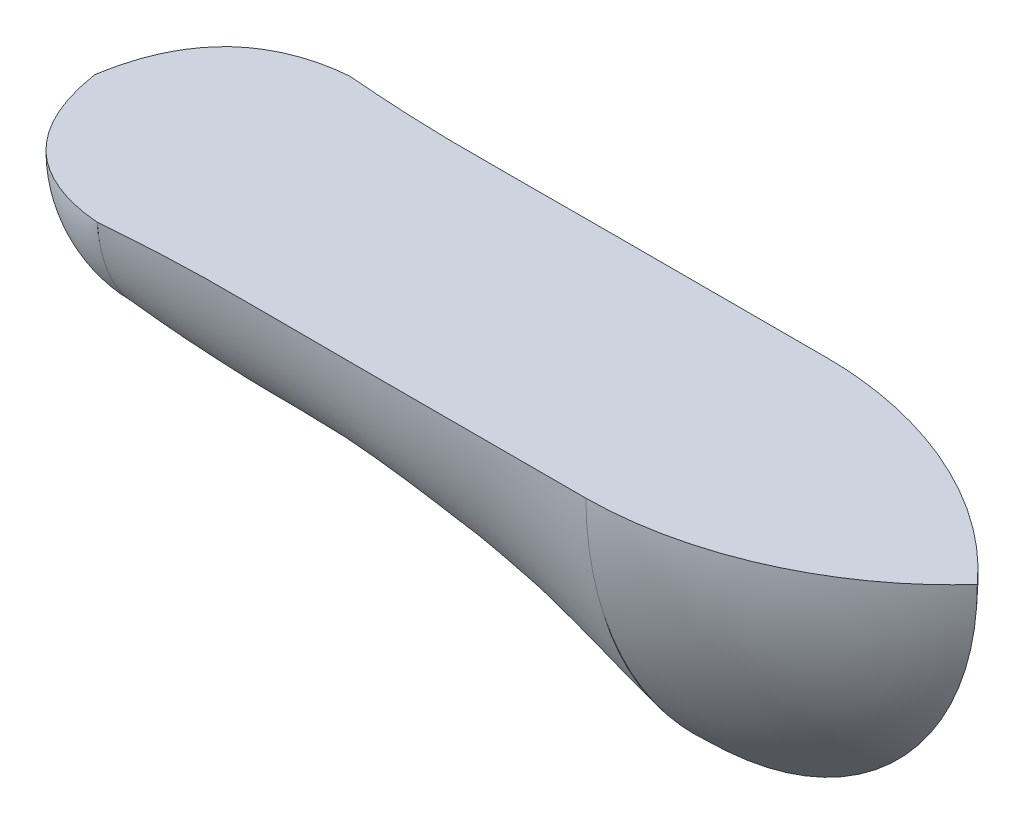
ISO-10303-21;
HEADER;
FILE_DESCRIPTION(('STEP AP214'),'2;1');
FILE_NAME('part.step','',(''),(''),'','','');
FILE_SCHEMA(('AUTOMOTIVE_DESIGN { 1 0 10303 214 1 1 1 1 }'));
ENDSEC;
DATA;
#1=APPLICATION_CONTEXT('core data for automotive mechanical design processes');
#2=APPLICATION_PROTOCOL_DEFINITION('international standard','automotive_design',2000,#1);
#3=PRODUCT_CONTEXT('',#1,'mechanical');
#4=PRODUCT('Part','Part','',(#3));
#5=PRODUCT_RELATED_PRODUCT_CATEGORY('part','',(#4));
#6=PRODUCT_DEFINITION_FORMATION('','',#4);
#7=PRODUCT_DEFINITION_CONTEXT('part definition',#1,'design');
#8=PRODUCT_DEFINITION('design','',#6,#7);
#9=PRODUCT_DEFINITION_SHAPE('','',#8);
#10=(LENGTH_UNIT() NAMED_UNIT(*) SI_UNIT(.MILLI.,.METRE.));
#11=(NAMED_UNIT(*) PLANE_ANGLE_UNIT() SI_UNIT($,.RADIAN.));
#12=(NAMED_UNIT(*) SI_UNIT($,.STERADIAN.) SOLID_ANGLE_UNIT());
#13=UNCERTAINTY_MEASURE_WITH_UNIT(LENGTH_MEASURE(1.E-05),#10,'distance_accuracy_value','');
#14=(GEOMETRIC_REPRESENTATION_CONTEXT(3) GLOBAL_UNCERTAINTY_ASSIGNED_CONTEXT((#13)) GLOBAL_UNIT_ASSIGNED_CONTEXT((#10,
#11,#12)) REPRESENTATION_CONTEXT('',''));
#15=CARTESIAN_POINT('',(0.,0.,0.));
#16=DIRECTION('',(0.,0.,1.));
#17=DIRECTION('',(1.,0.,0.));
#18=AXIS2_PLACEMENT_3D('',#15,#16,#17);
#19=CARTESIAN_POINT('',(131.816422352848,-59.0122671081871,34.7224523052919));
#20=DIRECTION('',(-1.,0.,0.));
#21=DIRECTION('',(0.,0.,1.));
#22=AXIS2_PLACEMENT_3D('',#19,#20,#21);
#23=PLANE('',#22);
#24=CARTESIAN_POINT('',(131.816422352848,0.,47.6997916780497));
#25=CARTESIAN_POINT('',(131.816422352848,-39.9283330976788,47.4989625477255));
#26=CARTESIAN_POINT('',(131.816422352848,-79.9498809986171,29.6913803366463));
#27=CARTESIAN_POINT('',(131.816422352848,-106.566200226632,0.));
#28=B_SPLINE_CURVE_WITH_KNOTS('',3,(#24,#25,#26,#27),.UNSPECIFIED.,.F.,.F.,(4,4),(0.,1.),.UNSPECIFIED.);
#29=CARTESIAN_POINT('',(131.816422352848,-43.4553935713046,40.6071201429122));
#30=VERTEX_POINT('',#29);
#31=CARTESIAN_POINT('',(131.816422352848,-90.4081398241308,15.2989475359607));
#32=VERTEX_POINT('',#31);
#33=EDGE_CURVE('E185',#30,#32,#28,.T.);
#34=ORIENTED_EDGE('',*,*,#33,.F.);
#35=CARTESIAN_POINT('',(131.816422352848,0.,47.6997916780497));
#36=CARTESIAN_POINT('',(131.816422352848,-64.7414341030582,45.5950087715589));
#37=CARTESIAN_POINT('',(131.816422352848,-106.566200226632,0.));
#38=B_SPLINE_CURVE_WITH_KNOTS('',2,(#35,#36,#37),.UNSPECIFIED.,.F.,.F.,(3,3),(0.,1.),.UNSPECIFIED.);
#39=EDGE_CURVE('E70',#30,#32,#38,.T.);
#40=ORIENTED_EDGE('',*,*,#39,.T.);
#41=EDGE_LOOP('',(#34,#40));
#42=FACE_BOUND('',#41,.T.);
#43=ADVANCED_FACE('F65',(#42),#23,.F.);
#44=CARTESIAN_POINT('',(131.816422352848,-106.566200226632,0.));
#45=CARTESIAN_POINT('',(131.816422352848,-79.9498809986171,-29.6913803366464));
#46=CARTESIAN_POINT('',(131.816422352848,-39.9283330976788,-47.4989625477255));
#47=CARTESIAN_POINT('',(131.816422352848,0.,-47.6997916780497));
#48=B_SPLINE_CURVE_WITH_KNOTS('',3,(#44,#45,#46,#47),.UNSPECIFIED.,.F.,.F.,(4,4),(0.,1.),.UNSPECIFIED.);
#49=CARTESIAN_POINT('',(131.816422352848,-90.4081398241278,-15.2989475359631));
#50=VERTEX_POINT('',#49);
#51=CARTESIAN_POINT('',(131.816422352848,-43.4553931780699,-40.6071202658206));
#52=VERTEX_POINT('',#51);
#53=EDGE_CURVE('E84',#50,#52,#48,.T.);
#54=ORIENTED_EDGE('',*,*,#53,.F.);
#55=CARTESIAN_POINT('',(131.816422352848,0.,-47.6997916780497));
#56=CARTESIAN_POINT('',(131.816422352848,-64.7414341030582,-45.5950087715589));
#57=CARTESIAN_POINT('',(131.816422352848,-106.566200226632,0.));
#58=B_SPLINE_CURVE_WITH_KNOTS('',2,(#55,#56,#57),.UNSPECIFIED.,.F.,.F.,(3,3),(0.,1.),.UNSPECIFIED.);
#59=EDGE_CURVE('E209',#52,#50,#58,.T.);
#60=ORIENTED_EDGE('',*,*,#59,.F.);
#61=EDGE_LOOP('',(#54,#60));
#62=FACE_BOUND('',#61,.T.);
#63=ADVANCED_FACE('F613',(#62),#23,.F.);
#64=CARTESIAN_POINT('',(-58.6835776471518,-34.4172644207204,35.5589947041966));
#65=DIRECTION('',(-1.,0.,0.));
#66=DIRECTION('',(0.,0.,1.));
#67=AXIS2_PLACEMENT_3D('',#64,#65,#66);
#68=PLANE('',#67);
#69=CARTESIAN_POINT('',(-58.6835776471518,0.,-49.7894442540128));
#70=CARTESIAN_POINT('',(-58.6835776471518,-43.4345288414408,-46.2232672813869));
#71=CARTESIAN_POINT('',(-58.6835776471518,-50.8,0.));
#72=B_SPLINE_CURVE_WITH_KNOTS('',2,(#69,#70,#71),.UNSPECIFIED.,.F.,.F.,(3,3),(0.,1.),.UNSPECIFIED.);
#73=CARTESIAN_POINT('',(-58.6835776471519,-44.1716494014847,-21.8945675320616));
#74=VERTEX_POINT('',#73);
#75=CARTESIAN_POINT('',(-58.6835776471518,-32.6460209973409,-37.2045900628193));
#76=VERTEX_POINT('',#75);
#77=EDGE_CURVE('E341',#74,#76,#72,.F.);
#78=ORIENTED_EDGE('',*,*,#77,.F.);
#79=CARTESIAN_POINT('',(-58.6835776471518,0.,-49.7894442540128));
#80=CARTESIAN_POINT('',(-58.6835776471518,-11.3053774098099,-49.0060485353922));
#81=CARTESIAN_POINT('',(-58.6835776471518,-30.0354301971617,-43.0409059333521));
#82=CARTESIAN_POINT('',(-58.6835776471518,-45.8648995414801,-21.5469878436581));
#83=CARTESIAN_POINT('',(-58.6835776471518,-49.5760104239876,-7.53480010945913));
#84=CARTESIAN_POINT('',(-58.6835776471518,-50.8,0.));
#85=B_SPLINE_CURVE_WITH_KNOTS('',3,(#79,#80,#81,#82,#83,#84),.UNSPECIFIED.,.F.,.F.,(4,1,1,4),
(0.,0.445313014205887,0.703997856148716,1.),.UNSPECIFIED.);
#86=EDGE_CURVE('E92',#76,#74,#85,.T.);
#87=ORIENTED_EDGE('',*,*,#86,.F.);
#88=EDGE_LOOP('',(#78,#87));
#89=FACE_BOUND('',#88,.T.);
#90=ADVANCED_FACE('F67',(#89),#68,.T.);
#91=CARTESIAN_POINT('',(-58.6835776471518,-31.9653716330667,-37.7918671025434));
#92=VERTEX_POINT('',#91);
#93=CARTESIAN_POINT('',(-58.6835776471518,-12.0474860174323,-47.8044391261713));
#94=VERTEX_POINT('',#93);
#95=EDGE_CURVE('E322',#92,#94,#72,.F.);
#96=ORIENTED_EDGE('',*,*,#95,.F.);
#97=EDGE_CURVE('E494',#94,#92,#85,.T.);
#98=ORIENTED_EDGE('',*,*,#97,.F.);
#99=EDGE_LOOP('',(#96,#98));
#100=FACE_BOUND('',#99,.T.);
#101=ADVANCED_FACE('F605',(#100),#68,.T.);
#102=CARTESIAN_POINT('',(-58.6835776471518,0.,49.7894442540128));
#103=CARTESIAN_POINT('',(-58.6835776471518,-43.4345288414408,46.2232672813869));
#104=CARTESIAN_POINT('',(-58.6835776471518,-50.8,0.));
#105=B_SPLINE_CURVE_WITH_KNOTS('',2,(#102,#103,#104),.UNSPECIFIED.,.F.,.F.,(3,3),(0.,1.),.UNSPECIFIED.);
#106=CARTESIAN_POINT('',(-58.6835776471519,-31.9653716330448,37.7918671025619));
#107=VERTEX_POINT('',#106);
#108=CARTESIAN_POINT('',(-58.6835776471518,-12.0474860174339,47.8044391261709));
#109=VERTEX_POINT('',#108);
#110=EDGE_CURVE('E222',#107,#109,#105,.F.);
#111=ORIENTED_EDGE('',*,*,#110,.T.);
#112=CARTESIAN_POINT('',(-58.6835776471518,-50.8,0.));
#113=CARTESIAN_POINT('',(-58.6835776471518,-49.5760104239876,7.53480010945916));
#114=CARTESIAN_POINT('',(-58.6835776471518,-45.8648995414801,21.5469878436581));
#115=CARTESIAN_POINT('',(-58.6835776471518,-30.0354301971617,43.0409059333522));
#116=CARTESIAN_POINT('',(-58.6835776471518,-11.3053774098098,49.0060485353922));
#117=CARTESIAN_POINT('',(-58.6835776471518,0.,49.7894442540128));
#118=B_SPLINE_CURVE_WITH_KNOTS('',3,(#112,#113,#114,#115,#116,#117),.UNSPECIFIED.,.F.,.F.,(4,1,
1,4),(0.,0.296002143851284,0.554686985794113,1.),.UNSPECIFIED.);
#119=EDGE_CURVE('E482',#107,#109,#118,.T.);
#120=ORIENTED_EDGE('',*,*,#119,.F.);
#121=EDGE_LOOP('',(#111,#120));
#122=FACE_BOUND('',#121,.T.);
#123=ADVANCED_FACE('F607',(#122),#68,.T.);
#124=CARTESIAN_POINT('',(-58.6835776471518,-44.1716503534535,21.8945656162064));
#125=VERTEX_POINT('',#124);
#126=CARTESIAN_POINT('',(-58.6835776471518,-32.6460209973468,37.2045900628142));
#127=VERTEX_POINT('',#126);
#128=EDGE_CURVE('E76',#125,#127,#105,.F.);
#129=ORIENTED_EDGE('',*,*,#128,.T.);
#130=EDGE_CURVE('E452',#125,#127,#118,.T.);
#131=ORIENTED_EDGE('',*,*,#130,.F.);
#132=EDGE_LOOP('',(#129,#131));
#133=FACE_BOUND('',#132,.T.);
#134=ADVANCED_FACE('F612',(#133),#68,.T.);
#135=CARTESIAN_POINT('',(-58.6835776471518,-50.8,0.));
#136=VERTEX_POINT('',#135);
#137=CARTESIAN_POINT('',(-58.6835776471518,-48.9861214219064,-8.74181358001302));
#138=VERTEX_POINT('',#137);
#139=EDGE_CURVE('E509',#136,#138,#72,.F.);
#140=ORIENTED_EDGE('',*,*,#139,.F.);
#141=EDGE_CURVE('E175',#138,#136,#85,.T.);
#142=ORIENTED_EDGE('',*,*,#141,.F.);
#143=EDGE_LOOP('',(#140,#142));
#144=FACE_BOUND('',#143,.T.);
#145=ADVANCED_FACE('F508',(#144),#68,.T.);
#146=CARTESIAN_POINT('',(-58.6835776471518,-48.9861214219057,8.74181358001579));
#147=VERTEX_POINT('',#146);
#148=EDGE_CURVE('E12',#136,#147,#105,.F.);
#149=ORIENTED_EDGE('',*,*,#148,.T.);
#150=EDGE_CURVE('E477',#136,#147,#118,.T.);
#151=ORIENTED_EDGE('',*,*,#150,.F.);
#152=EDGE_LOOP('',(#149,#151));
#153=FACE_BOUND('',#152,.T.);
#154=ADVANCED_FACE('F253',(#153),#68,.T.);
#155=CARTESIAN_POINT('',(131.816422352848,-106.566200226632,0.));
#156=CARTESIAN_POINT('',(119.109169090257,-100.693059423052,0.));
#157=CARTESIAN_POINT('',(93.7178635933245,-89.6393239271695,0.));
#158=CARTESIAN_POINT('',(56.0367616243776,-68.8417754410907,0.));
#159=CARTESIAN_POINT('',(17.5720054016219,-62.3294225142498,0.));
#160=CARTESIAN_POINT('',(-20.7245857030779,-62.9126811219029,0.));
#161=CARTESIAN_POINT('',(-46.1895235930978,-55.4223423423423,0.));
#162=CARTESIAN_POINT('',(-58.6835776471519,-50.8,0.));
#163=CARTESIAN_POINT('',(131.816422352848,-78.6830228109162,30.3966725143726));
#164=CARTESIAN_POINT('',(119.111586844454,-74.7675956085296,30.3966725143726));
#165=CARTESIAN_POINT('',(93.7173839848812,-66.0066192149846,26.8829339201581));
#166=CARTESIAN_POINT('',(56.0348358832331,-59.027241803324,28.9816107978587));
#167=CARTESIAN_POINT('',(17.5799888660408,-53.2268620729555,27.2340470665521));
#168=CARTESIAN_POINT('',(-20.7546363783925,-56.1855331654728,26.1608503031107));
#169=CARTESIAN_POINT('',(-46.1240561681897,-48.9712474558555,30.46732333113));
#170=CARTESIAN_POINT('',(-58.6835776471519,-45.8896858942939,30.8155115209246));
#171=CARTESIAN_POINT('',(131.816422352848,-43.1609560687055,46.2966030737225));
#172=CARTESIAN_POINT('',(119.114004598651,-41.2032424675122,46.2966030737225));
#173=CARTESIAN_POINT('',(93.7169043764379,-36.1268445725948,42.7862740104161));
#174=CARTESIAN_POINT('',(56.0329101420887,-36.0799833229604,44.8697302820663));
#175=CARTESIAN_POINT('',(17.5879723304597,-32.450387901539,43.1768745136056));
#176=CARTESIAN_POINT('',(-20.7846870537071,-35.2146394581718,41.9007566429753));
#177=CARTESIAN_POINT('',(-46.0585887432817,-30.4971333417413,46.7156165593397));
#178=CARTESIAN_POINT('',(-58.6835776471519,-28.9563525609606,47.4119929389289));
#179=CARTESIAN_POINT('',(131.816422352848,0.,47.6997916780497));
#180=CARTESIAN_POINT('',(119.116422352848,0.,47.6997916780497));
#181=CARTESIAN_POINT('',(93.7164247679946,0.,47.710020270774));
#182=CARTESIAN_POINT('',(56.0309844009442,0.,47.6643584526229));
#183=CARTESIAN_POINT('',(17.5959557948787,0.,47.8284823411605));
#184=CARTESIAN_POINT('',(-20.8147377290218,0.,47.2197190195939));
#185=CARTESIAN_POINT('',(-45.9931213183736,0.,48.7448796846291));
#186=CARTESIAN_POINT('',(-58.6835776471519,0.,49.7894442540128));
#187=B_SPLINE_SURFACE_WITH_KNOTS('',3,3,((#155,#156,#157,#158,#159,#160,#161,#162),(#163,#164,
#165,#166,#167,#168,#169,#170),(#171,#172,#173,#174,#175,#176,#177,#178),(#179,#180,#181,#182,
#183,#184,#185,#186)),.UNSPECIFIED.,.F.,.F.,.F.,(4,4),(4,1,1,1,1,4),(0.,1.),(0.,
0.20255279436426,0.404659715342169,0.603036822376503,0.800558261550841,1.),.UNSPECIFIED.);
#188=CARTESIAN_POINT('',(131.816422352848,0.,47.6997916780497));
#189=VERTEX_POINT('',#188);
#190=EDGE_CURVE('E219',#189,#30,#38,.T.);
#191=CARTESIAN_POINT('',(131.816422352848,0.,47.6997916780497));
#192=CARTESIAN_POINT('',(119.116422352848,0.,47.6997916780497));
#193=CARTESIAN_POINT('',(93.7164247679946,0.,47.710020270774));
#194=CARTESIAN_POINT('',(56.0309844009442,0.,47.6643584526229));
#195=CARTESIAN_POINT('',(17.5959557948787,0.,47.8284823411605));
#196=CARTESIAN_POINT('',(-20.8147377290218,0.,47.2197190195939));
#197=CARTESIAN_POINT('',(-45.9931213183736,0.,48.7448796846291));
#198=CARTESIAN_POINT('',(-58.6835776471519,0.,49.7894442540128));
#199=B_SPLINE_CURVE_WITH_KNOTS('',3,(#191,#192,#193,#194,#195,#196,#197,#198),.UNSPECIFIED.,.F.,
.F.,(4,1,1,1,1,4),(0.,0.20255279436426,0.404659715342169,0.603036822376503,0.800558261550841,
1.),.UNSPECIFIED.);
#200=CARTESIAN_POINT('',(-58.6835776471518,0.,49.7894442540128));
#201=VERTEX_POINT('',#200);
#202=EDGE_CURVE('E218',#189,#201,#199,.T.);
#203=EDGE_CURVE('E413',#109,#201,#105,.F.);
#204=CARTESIAN_POINT('',(-58.6835776471518,-31.9745251926052,37.7841357895646));
#205=VERTEX_POINT('',#204);
#206=EDGE_CURVE('E291',#205,#107,#118,.T.);
#207=CARTESIAN_POINT('',(-58.6835776471519,-32.645089029017,37.2054115691293));
#208=VERTEX_POINT('',#207);
#209=EDGE_CURVE('E419',#208,#205,#105,.F.);
#210=EDGE_CURVE('E443',#127,#208,#118,.T.);
#211=EDGE_CURVE('E211',#147,#125,#105,.F.);
#212=CARTESIAN_POINT('',(131.816422352848,-106.566200226632,0.));
#213=CARTESIAN_POINT('',(119.109169090257,-100.693059423052,0.));
#214=CARTESIAN_POINT('',(93.7178635933245,-89.6393239271695,0.));
#215=CARTESIAN_POINT('',(56.0367616243776,-68.8417754410907,0.));
#216=CARTESIAN_POINT('',(17.5720054016219,-62.3294225142498,0.));
#217=CARTESIAN_POINT('',(-20.7245857030779,-62.9126811219029,0.));
#218=CARTESIAN_POINT('',(-46.1895235930978,-55.4223423423423,0.));
#219=CARTESIAN_POINT('',(-58.6835776471519,-50.8,0.));
#220=B_SPLINE_CURVE_WITH_KNOTS('',3,(#212,#213,#214,#215,#216,#217,#218,#219),.UNSPECIFIED.,.F.,
.F.,(4,1,1,1,1,4),(0.,0.20255279436426,0.404659715342169,0.603036822376503,0.800558261550841,
1.),.UNSPECIFIED.);
#221=CARTESIAN_POINT('',(131.816422352848,-106.566200226632,0.));
#222=VERTEX_POINT('',#221);
#223=EDGE_CURVE('E206',#222,#136,#220,.T.);
#224=EDGE_CURVE('E166',#32,#222,#38,.T.);
#225=ORIENTED_EDGE('',*,*,#190,.F.);
#226=ORIENTED_EDGE('',*,*,#202,.T.);
#227=ORIENTED_EDGE('',*,*,#203,.F.);
#228=ORIENTED_EDGE('',*,*,#110,.F.);
#229=ORIENTED_EDGE('',*,*,#206,.F.);
#230=ORIENTED_EDGE('',*,*,#209,.F.);
#231=ORIENTED_EDGE('',*,*,#210,.F.);
#232=ORIENTED_EDGE('',*,*,#128,.F.);
#233=ORIENTED_EDGE('',*,*,#211,.F.);
#234=ORIENTED_EDGE('',*,*,#148,.F.);
#235=ORIENTED_EDGE('',*,*,#223,.F.);
#236=ORIENTED_EDGE('',*,*,#224,.F.);
#237=ORIENTED_EDGE('',*,*,#39,.F.);
#238=EDGE_LOOP('',(#225,#226,#227,#228,#229,#230,#231,#232,#233,#234,#235,#236,#237));
#239=FACE_BOUND('',#238,.T.);
#240=ADVANCED_FACE('F215',(#239),#187,.T.);
#241=CARTESIAN_POINT('',(131.816422352848,0.,47.6997916780497));
#242=DIRECTION('',(0.,1.,0.));
#243=DIRECTION('',(0.,0.,-1.));
#244=AXIS2_PLACEMENT_3D('',#241,#242,#243);
#245=PLANE('',#244);
#246=CARTESIAN_POINT('',(238.38262257948,3.60822483003176E-13,0.));
#247=CARTESIAN_POINT('',(211.766303351465,2.77555756156289E-13,-29.6913803366464));
#248=CARTESIAN_POINT('',(171.744755450527,1.38777878078145E-13,-47.4989625477255));
#249=CARTESIAN_POINT('',(131.816422352848,0.,-47.6997916780497));
#250=B_SPLINE_CURVE_WITH_KNOTS('',3,(#246,#247,#248,#249),.UNSPECIFIED.,.F.,.F.,(4,4),(0.,1.),.UNSPECIFIED.);
#251=CARTESIAN_POINT('',(238.38262257948,3.60822483003176E-13,0.));
#252=VERTEX_POINT('',#251);
#253=CARTESIAN_POINT('',(131.816422352848,-9.0974127804038E-06,-47.6997913822869));
#254=VERTEX_POINT('',#253);
#255=EDGE_CURVE('E191',#252,#254,#250,.T.);
#256=ORIENTED_EDGE('',*,*,#255,.T.);
#257=CARTESIAN_POINT('',(131.816422352848,0.,-47.6997916780497));
#258=CARTESIAN_POINT('',(119.116422352848,0.,-47.6997916780497));
#259=CARTESIAN_POINT('',(93.7164247679946,0.,-47.710020270774));
#260=CARTESIAN_POINT('',(56.0309844009442,0.,-47.6643584526229));
#261=CARTESIAN_POINT('',(17.5959557948787,0.,-47.8284823411605));
#262=CARTESIAN_POINT('',(-20.8147377290218,0.,-47.2197190195939));
#263=CARTESIAN_POINT('',(-45.9931213183736,0.,-48.7448796846291));
#264=CARTESIAN_POINT('',(-58.6835776471519,0.,-49.7894442540128));
#265=B_SPLINE_CURVE_WITH_KNOTS('',3,(#257,#258,#259,#260,#261,#262,#263,#264),.UNSPECIFIED.,.F.,
.F.,(4,1,1,1,1,4),(0.,0.20255279436426,0.404659715342169,0.603036822376503,0.800558261550841,
1.),.UNSPECIFIED.);
#266=CARTESIAN_POINT('',(-58.6835776471518,0.,-49.7894442540128));
#267=VERTEX_POINT('',#266);
#268=EDGE_CURVE('E385',#254,#267,#265,.T.);
#269=ORIENTED_EDGE('',*,*,#268,.T.);
#270=CARTESIAN_POINT('',(-58.6835776471518,0.,-49.7894442540128));
#271=CARTESIAN_POINT('',(-69.9889550569617,0.,-49.0060485353922));
#272=CARTESIAN_POINT('',(-88.7190078443135,1.04083408558608E-13,-43.0409059333521));
#273=CARTESIAN_POINT('',(-104.548477188632,1.59594559789866E-13,-21.5469878436581));
#274=CARTESIAN_POINT('',(-108.259588071139,1.73472347597681E-13,-7.53480010945913));
#275=CARTESIAN_POINT('',(-109.483577647152,1.80411241501588E-13,0.));
#276=B_SPLINE_CURVE_WITH_KNOTS('',3,(#270,#271,#272,#273,#274,#275),.UNSPECIFIED.,.F.,.F.,(4,1,
1,4),(0.,0.445313014205887,0.703997856148716,1.),.UNSPECIFIED.);
#277=CARTESIAN_POINT('',(-109.483577647152,1.80411241501588E-13,0.));
#278=VERTEX_POINT('',#277);
#279=EDGE_CURVE('E437',#267,#278,#276,.T.);
#280=ORIENTED_EDGE('',*,*,#279,.T.);
#281=CARTESIAN_POINT('',(-109.483577647152,1.80411241501588E-13,0.));
#282=CARTESIAN_POINT('',(-108.25958807114,1.73472347597681E-13,7.53480010945916));
#283=CARTESIAN_POINT('',(-104.548477188632,1.59594559789866E-13,21.5469878436581));
#284=CARTESIAN_POINT('',(-88.7190078443135,1.04083408558608E-13,43.0409059333522));
#285=CARTESIAN_POINT('',(-69.9889550569617,0.,49.0060485353922));
#286=CARTESIAN_POINT('',(-58.6835776471518,0.,49.7894442540128));
#287=B_SPLINE_CURVE_WITH_KNOTS('',3,(#281,#282,#283,#284,#285,#286),.UNSPECIFIED.,.F.,.F.,(4,1,
1,4),(0.,0.296002143851284,0.554686985794113,1.),.UNSPECIFIED.);
#288=EDGE_CURVE('E432',#278,#201,#287,.T.);
#289=ORIENTED_EDGE('',*,*,#288,.T.);
#290=ORIENTED_EDGE('',*,*,#202,.F.);
#291=CARTESIAN_POINT('',(131.816422352848,0.,47.6997916780497));
#292=CARTESIAN_POINT('',(171.744755450527,1.38777878078145E-13,47.4989625477255));
#293=CARTESIAN_POINT('',(211.766303351465,2.77555756156289E-13,29.6913803366463));
#294=CARTESIAN_POINT('',(238.38262257948,3.60822483003176E-13,0.));
#295=B_SPLINE_CURVE_WITH_KNOTS('',3,(#291,#292,#293,#294),.UNSPECIFIED.,.F.,.F.,(4,4),(0.,1.),.UNSPECIFIED.);
#296=EDGE_CURVE('E198',#189,#252,#295,.T.);
#297=ORIENTED_EDGE('',*,*,#296,.T.);
#298=EDGE_LOOP('',(#256,#269,#280,#289,#290,#297));
#299=FACE_BOUND('',#298,.T.);
#300=ADVANCED_FACE('F252',(#299),#245,.T.);
#301=CARTESIAN_POINT('',(131.816422352848,-106.566200226632,0.));
#302=CARTESIAN_POINT('',(119.109169090257,-100.693059423052,0.));
#303=CARTESIAN_POINT('',(93.7178635933245,-89.6393239271695,0.));
#304=CARTESIAN_POINT('',(56.0367616243776,-68.8417754410907,0.));
#305=CARTESIAN_POINT('',(17.5720054016219,-62.3294225142498,0.));
#306=CARTESIAN_POINT('',(-20.7245857030779,-62.9126811219029,0.));
#307=CARTESIAN_POINT('',(-46.1895235930978,-55.4223423423423,0.));
#308=CARTESIAN_POINT('',(-58.6835776471519,-50.8,0.));
#309=CARTESIAN_POINT('',(131.816422352848,-78.6830228109162,-30.3966725143726));
#310=CARTESIAN_POINT('',(119.111586844454,-74.7675956085296,-30.3966725143726));
#311=CARTESIAN_POINT('',(93.7173839848812,-66.0066192149846,-26.8829339201581));
#312=CARTESIAN_POINT('',(56.0348358832331,-59.027241803324,-28.9816107978587));
#313=CARTESIAN_POINT('',(17.5799888660408,-53.2268620729555,-27.2340470665521));
#314=CARTESIAN_POINT('',(-20.7546363783925,-56.1855331654728,-26.1608503031107));
#315=CARTESIAN_POINT('',(-46.1240561681897,-48.9712474558555,-30.46732333113));
#316=CARTESIAN_POINT('',(-58.6835776471519,-45.8896858942939,-30.8155115209246));
#317=CARTESIAN_POINT('',(131.816422352848,-43.1609560687055,-46.2966030737225));
#318=CARTESIAN_POINT('',(119.114004598651,-41.2032424675122,-46.2966030737225));
#319=CARTESIAN_POINT('',(93.7169043764379,-36.1268445725948,-42.7862740104161));
#320=CARTESIAN_POINT('',(56.0329101420887,-36.0799833229604,-44.8697302820663));
#321=CARTESIAN_POINT('',(17.5879723304597,-32.450387901539,-43.1768745136056));
#322=CARTESIAN_POINT('',(-20.7846870537071,-35.2146394581718,-41.9007566429753));
#323=CARTESIAN_POINT('',(-46.0585887432817,-30.4971333417413,-46.7156165593397));
#324=CARTESIAN_POINT('',(-58.6835776471519,-28.9563525609606,-47.4119929389289));
#325=CARTESIAN_POINT('',(131.816422352848,0.,-47.6997916780497));
#326=CARTESIAN_POINT('',(119.116422352848,0.,-47.6997916780497));
#327=CARTESIAN_POINT('',(93.7164247679946,0.,-47.710020270774));
#328=CARTESIAN_POINT('',(56.0309844009442,0.,-47.6643584526229));
#329=CARTESIAN_POINT('',(17.5959557948787,0.,-47.8284823411605));
#330=CARTESIAN_POINT('',(-20.8147377290218,0.,-47.2197190195939));
#331=CARTESIAN_POINT('',(-45.9931213183736,0.,-48.7448796846291));
#332=CARTESIAN_POINT('',(-58.6835776471519,0.,-49.7894442540128));
#333=B_SPLINE_SURFACE_WITH_KNOTS('',3,3,((#301,#302,#303,#304,#305,#306,#307,#308),(#309,#310,
#311,#312,#313,#314,#315,#316),(#317,#318,#319,#320,#321,#322,#323,#324),(#325,#326,#327,#328,
#329,#330,#331,#332)),.UNSPECIFIED.,.F.,.F.,.F.,(4,4),(4,1,1,1,1,4),(0.,1.),(0.,
0.20255279436426,0.404659715342169,0.603036822376503,0.800558261550841,1.),.UNSPECIFIED.);
#334=EDGE_CURVE('E602',#254,#52,#58,.T.);
#335=EDGE_CURVE('E197',#50,#222,#58,.T.);
#336=EDGE_CURVE('E510',#138,#74,#72,.F.);
#337=CARTESIAN_POINT('',(-58.6835776471518,-32.6450890290172,-37.2054115691291));
#338=VERTEX_POINT('',#337);
#339=EDGE_CURVE('E346',#76,#338,#72,.F.);
#340=CARTESIAN_POINT('',(-58.6835776471518,-31.9745251926126,-37.7841357895584));
#341=VERTEX_POINT('',#340);
#342=EDGE_CURVE('E519',#338,#341,#72,.F.);
#343=EDGE_CURVE('E518',#341,#92,#72,.F.);
#344=EDGE_CURVE('E516',#94,#267,#72,.F.);
#345=ORIENTED_EDGE('',*,*,#334,.T.);
#346=ORIENTED_EDGE('',*,*,#59,.T.);
#347=ORIENTED_EDGE('',*,*,#335,.T.);
#348=ORIENTED_EDGE('',*,*,#223,.T.);
#349=ORIENTED_EDGE('',*,*,#139,.T.);
#350=ORIENTED_EDGE('',*,*,#336,.T.);
#351=ORIENTED_EDGE('',*,*,#77,.T.);
#352=ORIENTED_EDGE('',*,*,#339,.T.);
#353=ORIENTED_EDGE('',*,*,#342,.T.);
#354=ORIENTED_EDGE('',*,*,#343,.T.);
#355=ORIENTED_EDGE('',*,*,#95,.T.);
#356=ORIENTED_EDGE('',*,*,#344,.T.);
#357=ORIENTED_EDGE('',*,*,#268,.F.);
#358=EDGE_LOOP('',(#345,#346,#347,#348,#349,#350,#351,#352,#353,#354,#355,#356,#357));
#359=FACE_BOUND('',#358,.T.);
#360=ADVANCED_FACE('F204',(#359),#333,.F.);
#361=CARTESIAN_POINT('',(-58.6835776471518,-35.0739121633583,-34.8919570242977));
#362=DIRECTION('',(1.,0.,0.));
#363=DIRECTION('',(0.,0.,-1.));
#364=AXIS2_PLACEMENT_3D('',#361,#362,#363);
#365=PLANE('',#364);
#366=EDGE_CURVE('E471',#147,#125,#118,.T.);
#367=ORIENTED_EDGE('',*,*,#366,.F.);
#368=ORIENTED_EDGE('',*,*,#211,.T.);
#369=EDGE_LOOP('',(#367,#368));
#370=FACE_BOUND('',#369,.T.);
#371=ADVANCED_FACE('F366',(#370),#365,.T.);
#372=EDGE_CURVE('E484',#109,#201,#118,.T.);
#373=ORIENTED_EDGE('',*,*,#372,.F.);
#374=ORIENTED_EDGE('',*,*,#203,.T.);
#375=EDGE_LOOP('',(#373,#374));
#376=FACE_BOUND('',#375,.T.);
#377=ADVANCED_FACE('F673',(#376),#365,.T.);
#378=EDGE_CURVE('E486',#267,#94,#85,.T.);
#379=ORIENTED_EDGE('',*,*,#378,.F.);
#380=ORIENTED_EDGE('',*,*,#344,.F.);
#381=EDGE_LOOP('',(#379,#380));
#382=FACE_BOUND('',#381,.T.);
#383=ADVANCED_FACE('F538',(#382),#365,.T.);
#384=CARTESIAN_POINT('',(-58.6835776471518,0.,-49.7894442540128));
#385=DIRECTION('',(0.,0.,1.));
#386=AXIS1_PLACEMENT('',#384,#385);
#387=SURFACE_OF_REVOLUTION('',#276,#386);
#388=ORIENTED_EDGE('',*,*,#378,.T.);
#389=ORIENTED_EDGE('',*,*,#97,.T.);
#390=ORIENTED_EDGE('',*,*,#343,.F.);
#391=ORIENTED_EDGE('',*,*,#342,.F.);
#392=ORIENTED_EDGE('',*,*,#339,.F.);
#393=ORIENTED_EDGE('',*,*,#86,.T.);
#394=EDGE_CURVE('E503',#74,#138,#85,.T.);
#395=ORIENTED_EDGE('',*,*,#394,.T.);
#396=ORIENTED_EDGE('',*,*,#141,.T.);
#397=CARTESIAN_POINT('',(-58.6835776471518,0.,0.));
#398=DIRECTION('',(0.,0.,1.));
#399=DIRECTION('',(1.,0.,0.));
#400=AXIS2_PLACEMENT_3D('',#397,#398,#399);
#401=CIRCLE('',#400,50.8);
#402=EDGE_CURVE('E427',#278,#136,#401,.T.);
#403=ORIENTED_EDGE('',*,*,#402,.F.);
#404=ORIENTED_EDGE('',*,*,#279,.F.);
#405=EDGE_LOOP('',(#388,#389,#390,#391,#392,#393,#395,#396,#403,#404));
#406=FACE_BOUND('',#405,.T.);
#407=ADVANCED_FACE('F505',(#406),#387,.T.);
#408=CARTESIAN_POINT('',(-58.6835776471518,0.,-49.7894442540128));
#409=DIRECTION('',(0.,0.,1.));
#410=AXIS1_PLACEMENT('',#408,#409);
#411=SURFACE_OF_REVOLUTION('',#287,#410);
#412=ORIENTED_EDGE('',*,*,#288,.F.);
#413=ORIENTED_EDGE('',*,*,#402,.T.);
#414=ORIENTED_EDGE('',*,*,#150,.T.);
#415=ORIENTED_EDGE('',*,*,#366,.T.);
#416=ORIENTED_EDGE('',*,*,#130,.T.);
#417=ORIENTED_EDGE('',*,*,#210,.T.);
#418=ORIENTED_EDGE('',*,*,#209,.T.);
#419=ORIENTED_EDGE('',*,*,#206,.T.);
#420=ORIENTED_EDGE('',*,*,#119,.T.);
#421=ORIENTED_EDGE('',*,*,#372,.T.);
#422=EDGE_LOOP('',(#412,#413,#414,#415,#416,#417,#418,#419,#420,#421));
#423=FACE_BOUND('',#422,.T.);
#424=ADVANCED_FACE('F367',(#423),#411,.T.);
#425=ORIENTED_EDGE('',*,*,#394,.F.);
#426=ORIENTED_EDGE('',*,*,#336,.F.);
#427=EDGE_LOOP('',(#425,#426));
#428=FACE_BOUND('',#427,.T.);
#429=ADVANCED_FACE('F539',(#428),#365,.T.);
#430=CARTESIAN_POINT('',(131.816422352848,-58.27510531444,34.9088525413956));
#431=DIRECTION('',(-1.,0.,0.));
#432=DIRECTION('',(0.,0.,1.));
#433=AXIS2_PLACEMENT_3D('',#430,#431,#432);
#434=PLANE('',#433);
#435=EDGE_CURVE('E582',#189,#30,#28,.T.);
#436=ORIENTED_EDGE('',*,*,#435,.F.);
#437=ORIENTED_EDGE('',*,*,#190,.T.);
#438=EDGE_LOOP('',(#436,#437));
#439=FACE_BOUND('',#438,.T.);
#440=ADVANCED_FACE('F551',(#439),#434,.T.);
#441=EDGE_CURVE('E169',#32,#222,#28,.T.);
#442=ORIENTED_EDGE('',*,*,#441,.F.);
#443=ORIENTED_EDGE('',*,*,#224,.T.);
#444=EDGE_LOOP('',(#442,#443));
#445=FACE_BOUND('',#444,.T.);
#446=ADVANCED_FACE('F168',(#445),#434,.T.);
#447=EDGE_CURVE('E189',#222,#50,#48,.T.);
#448=ORIENTED_EDGE('',*,*,#447,.F.);
#449=ORIENTED_EDGE('',*,*,#335,.F.);
#450=EDGE_LOOP('',(#448,#449));
#451=FACE_BOUND('',#450,.T.);
#452=ADVANCED_FACE('F196',(#451),#434,.T.);
#453=CARTESIAN_POINT('',(131.816422352848,0.,47.6997916780497));
#454=DIRECTION('',(0.,0.,-1.));
#455=AXIS1_PLACEMENT('',#453,#454);
#456=SURFACE_OF_REVOLUTION('',#295,#455);
#457=ORIENTED_EDGE('',*,*,#435,.T.);
#458=ORIENTED_EDGE('',*,*,#33,.T.);
#459=ORIENTED_EDGE('',*,*,#441,.T.);
#460=CARTESIAN_POINT('',(131.816422352848,0.,0.));
#461=DIRECTION('',(0.,0.,-1.));
#462=DIRECTION('',(-1.,0.,0.));
#463=AXIS2_PLACEMENT_3D('',#460,#461,#462);
#464=CIRCLE('',#463,106.566200226632);
#465=EDGE_CURVE('E176',#252,#222,#464,.T.);
#466=ORIENTED_EDGE('',*,*,#465,.F.);
#467=ORIENTED_EDGE('',*,*,#296,.F.);
#468=EDGE_LOOP('',(#457,#458,#459,#466,#467));
#469=FACE_BOUND('',#468,.T.);
#470=ADVANCED_FACE('F181',(#469),#456,.T.);
#471=CARTESIAN_POINT('',(131.816422352848,0.,47.6997916780497));
#472=DIRECTION('',(0.,0.,-1.));
#473=AXIS1_PLACEMENT('',#471,#472);
#474=SURFACE_OF_REVOLUTION('',#250,#473);
#475=ORIENTED_EDGE('',*,*,#255,.F.);
#476=ORIENTED_EDGE('',*,*,#465,.T.);
#477=ORIENTED_EDGE('',*,*,#447,.T.);
#478=ORIENTED_EDGE('',*,*,#53,.T.);
#479=EDGE_CURVE('E575',#52,#254,#48,.T.);
#480=ORIENTED_EDGE('',*,*,#479,.T.);
#481=EDGE_LOOP('',(#475,#476,#477,#478,#480));
#482=FACE_BOUND('',#481,.T.);
#483=ADVANCED_FACE('F188',(#482),#474,.T.);
#484=ORIENTED_EDGE('',*,*,#479,.F.);
#485=ORIENTED_EDGE('',*,*,#334,.F.);
#486=EDGE_LOOP('',(#484,#485));
#487=FACE_BOUND('',#486,.T.);
#488=ADVANCED_FACE('F556',(#487),#434,.T.);
#489=CLOSED_SHELL('',(#43,#63,#90,#101,#123,#134,#145,#154,#240,#300,#360,#371,#377,#383,#407,
#424,#429,#440,#446,#452,#470,#483,#488));
#490=MANIFOLD_SOLID_BREP('B2',#489);
#491=ADVANCED_BREP_SHAPE_REPRESENTATION('',(#18,#490),#14);
#492=SHAPE_DEFINITION_REPRESENTATION(#9,#491);
ENDSEC;
END-ISO-10303-21;
